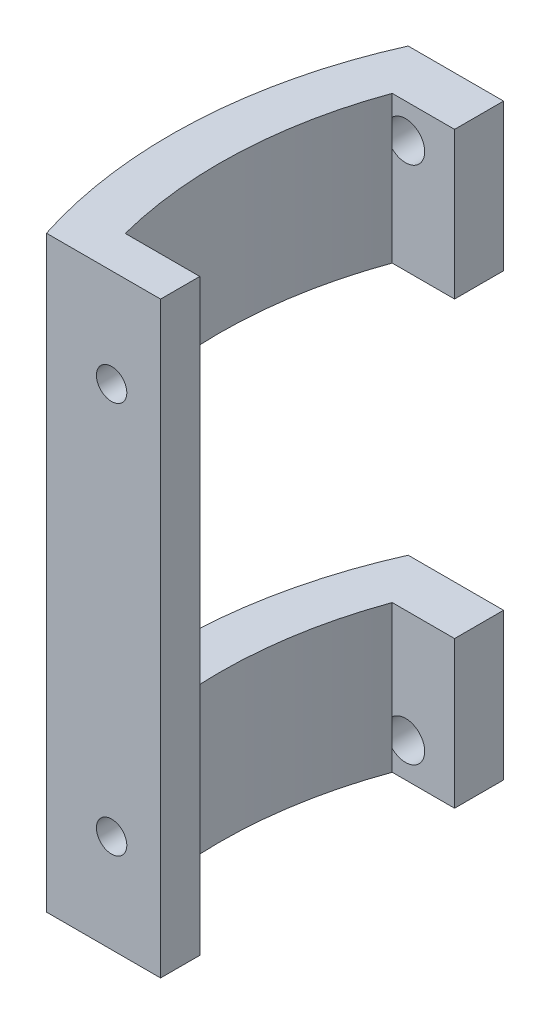
ISO-10303-21;
HEADER;
FILE_DESCRIPTION(('STEP AP214'),'2;1');
FILE_NAME('part.step','',(''),(''),'','','');
FILE_SCHEMA(('AUTOMOTIVE_DESIGN { 1 0 10303 214 1 1 1 1 }'));
ENDSEC;
DATA;
#1=APPLICATION_CONTEXT('core data for automotive mechanical design processes');
#2=APPLICATION_PROTOCOL_DEFINITION('international standard','automotive_design',2000,#1);
#3=PRODUCT_CONTEXT('',#1,'mechanical');
#4=PRODUCT('Part','Part','',(#3));
#5=PRODUCT_RELATED_PRODUCT_CATEGORY('part','',(#4));
#6=PRODUCT_DEFINITION_FORMATION('','',#4);
#7=PRODUCT_DEFINITION_CONTEXT('part definition',#1,'design');
#8=PRODUCT_DEFINITION('design','',#6,#7);
#9=PRODUCT_DEFINITION_SHAPE('','',#8);
#10=(LENGTH_UNIT() NAMED_UNIT(*) SI_UNIT(.MILLI.,.METRE.));
#11=(NAMED_UNIT(*) PLANE_ANGLE_UNIT() SI_UNIT($,.RADIAN.));
#12=(NAMED_UNIT(*) SI_UNIT($,.STERADIAN.) SOLID_ANGLE_UNIT());
#13=UNCERTAINTY_MEASURE_WITH_UNIT(LENGTH_MEASURE(1.E-05),#10,'distance_accuracy_value','');
#14=(GEOMETRIC_REPRESENTATION_CONTEXT(3) GLOBAL_UNCERTAINTY_ASSIGNED_CONTEXT((#13)) GLOBAL_UNIT_ASSIGNED_CONTEXT((#10,
#11,#12)) REPRESENTATION_CONTEXT('',''));
#15=CARTESIAN_POINT('',(0.,0.,0.));
#16=DIRECTION('',(0.,0.,1.));
#17=DIRECTION('',(1.,0.,0.));
#18=AXIS2_PLACEMENT_3D('',#15,#16,#17);
#19=CARTESIAN_POINT('',(0.,60.,0.));
#20=DIRECTION('',(0.,-1.,0.));
#21=DIRECTION('',(0.,0.,-1.));
#22=AXIS2_PLACEMENT_3D('',#19,#20,#21);
#23=CYLINDRICAL_SURFACE('',#22,44.);
#24=CARTESIAN_POINT('',(0.,15.,0.));
#25=DIRECTION('',(0.,-1.,0.));
#26=DIRECTION('',(0.,0.,-1.));
#27=AXIS2_PLACEMENT_3D('',#24,#25,#26);
#28=CIRCLE('',#27,44.);
#29=CARTESIAN_POINT('',(-42.6028168082816,15.,11.));
#30=VERTEX_POINT('',#29);
#31=CARTESIAN_POINT('',(-41.3642357598929,15.,-15.));
#32=VERTEX_POINT('',#31);
#33=EDGE_CURVE('E248',#30,#32,#28,.T.);
#34=ORIENTED_EDGE('',*,*,#33,.F.);
#35=DIRECTION('',(0.,-1.,0.));
#36=VECTOR('',#35,1.);
#37=CARTESIAN_POINT('',(-42.6028168082816,60.,11.));
#38=LINE('',#37,#36);
#39=CARTESIAN_POINT('',(-42.6028168082816,0.,11.));
#40=VERTEX_POINT('',#39);
#41=EDGE_CURVE('E304',#30,#40,#38,.T.);
#42=ORIENTED_EDGE('',*,*,#41,.T.);
#43=CARTESIAN_POINT('',(0.,0.,0.));
#44=DIRECTION('',(0.,1.,0.));
#45=DIRECTION('',(0.,0.,1.));
#46=AXIS2_PLACEMENT_3D('',#43,#44,#45);
#47=CIRCLE('',#46,44.);
#48=CARTESIAN_POINT('',(-41.3642357598929,0.,-15.));
#49=VERTEX_POINT('',#48);
#50=EDGE_CURVE('E269',#49,#40,#47,.T.);
#51=ORIENTED_EDGE('',*,*,#50,.F.);
#52=DIRECTION('',(0.,-1.,0.));
#53=VECTOR('',#52,1.);
#54=CARTESIAN_POINT('',(-41.3642357598929,60.,-15.));
#55=LINE('',#54,#53);
#56=CARTESIAN_POINT('',(-41.3642357598929,2.10667276225952,-15.));
#57=VERTEX_POINT('',#56);
#58=EDGE_CURVE('E196',#57,#49,#55,.T.);
#59=ORIENTED_EDGE('',*,*,#58,.F.);
#60=CARTESIAN_POINT('',(-41.3642357598929,4.89332723774048,-15.));
#61=VERTEX_POINT('',#60);
#62=EDGE_CURVE('E198',#61,#57,#55,.T.);
#63=ORIENTED_EDGE('',*,*,#62,.F.);
#64=EDGE_CURVE('E54',#32,#61,#55,.T.);
#65=ORIENTED_EDGE('',*,*,#64,.F.);
#66=EDGE_LOOP('',(#34,#42,#51,#59,#63,#65));
#67=FACE_BOUND('',#66,.T.);
#68=ADVANCED_FACE('F44',(#67),#23,.F.);
#69=CARTESIAN_POINT('',(0.,60.,-15.));
#70=DIRECTION('',(0.,0.,-1.));
#71=DIRECTION('',(-1.,0.,0.));
#72=AXIS2_PLACEMENT_3D('',#69,#70,#71);
#73=PLANE('',#72);
#74=DIRECTION('',(0.,-1.,0.));
#75=VECTOR('',#74,1.);
#76=CARTESIAN_POINT('',(-35.,60.,-15.));
#77=LINE('',#76,#75);
#78=CARTESIAN_POINT('',(-35.,15.,-15.));
#79=VERTEX_POINT('',#78);
#80=CARTESIAN_POINT('',(-35.,0.,-15.));
#81=VERTEX_POINT('',#80);
#82=EDGE_CURVE('E187',#79,#81,#77,.T.);
#83=ORIENTED_EDGE('',*,*,#82,.F.);
#84=DIRECTION('',(-1.,0.,0.));
#85=VECTOR('',#84,1.);
#86=CARTESIAN_POINT('',(0.,15.,-15.));
#87=LINE('',#86,#85);
#88=EDGE_CURVE('E241',#79,#32,#87,.T.);
#89=ORIENTED_EDGE('',*,*,#88,.T.);
#90=ORIENTED_EDGE('',*,*,#64,.T.);
#91=CARTESIAN_POINT('',(-40.,3.5,-15.));
#92=DIRECTION('',(0.,0.,-1.));
#93=DIRECTION('',(-1.,0.,0.));
#94=AXIS2_PLACEMENT_3D('',#91,#92,#93);
#95=CIRCLE('',#94,1.95);
#96=EDGE_CURVE('E258',#57,#61,#95,.F.);
#97=ORIENTED_EDGE('',*,*,#96,.F.);
#98=ORIENTED_EDGE('',*,*,#58,.T.);
#99=DIRECTION('',(1.,0.,0.));
#100=VECTOR('',#99,1.);
#101=CARTESIAN_POINT('',(0.,0.,-15.));
#102=LINE('',#101,#100);
#103=EDGE_CURVE('E308',#49,#81,#102,.T.);
#104=ORIENTED_EDGE('',*,*,#103,.T.);
#105=EDGE_LOOP('',(#83,#89,#90,#97,#98,#104));
#106=FACE_BOUND('',#105,.T.);
#107=ADVANCED_FACE('F386',(#106),#73,.F.);
#108=CARTESIAN_POINT('',(-35.,60.,0.));
#109=DIRECTION('',(1.,0.,0.));
#110=DIRECTION('',(0.,0.,-1.));
#111=AXIS2_PLACEMENT_3D('',#108,#109,#110);
#112=PLANE('',#111);
#113=DIRECTION('',(0.,0.,-1.));
#114=VECTOR('',#113,1.);
#115=CARTESIAN_POINT('',(-35.,15.,11.));
#116=LINE('',#115,#114);
#117=CARTESIAN_POINT('',(-35.,15.,-20.));
#118=VERTEX_POINT('',#117);
#119=EDGE_CURVE('E169',#79,#118,#116,.T.);
#120=ORIENTED_EDGE('',*,*,#119,.F.);
#121=ORIENTED_EDGE('',*,*,#82,.T.);
#122=DIRECTION('',(0.,0.,1.));
#123=VECTOR('',#122,1.);
#124=CARTESIAN_POINT('',(-35.,0.,0.));
#125=LINE('',#124,#123);
#126=CARTESIAN_POINT('',(-35.,0.,-20.));
#127=VERTEX_POINT('',#126);
#128=EDGE_CURVE('E311',#127,#81,#125,.T.);
#129=ORIENTED_EDGE('',*,*,#128,.F.);
#130=DIRECTION('',(0.,-1.,0.));
#131=VECTOR('',#130,1.);
#132=CARTESIAN_POINT('',(-35.,60.,-20.));
#133=LINE('',#132,#131);
#134=EDGE_CURVE('E188',#118,#127,#133,.T.);
#135=ORIENTED_EDGE('',*,*,#134,.F.);
#136=EDGE_LOOP('',(#120,#121,#129,#135));
#137=FACE_BOUND('',#136,.T.);
#138=ADVANCED_FACE('F384',(#137),#112,.T.);
#139=CARTESIAN_POINT('',(0.,60.,-20.));
#140=DIRECTION('',(0.,0.,-1.));
#141=DIRECTION('',(-1.,0.,0.));
#142=AXIS2_PLACEMENT_3D('',#139,#140,#141);
#143=PLANE('',#142);
#144=DIRECTION('',(1.,0.,0.));
#145=VECTOR('',#144,1.);
#146=CARTESIAN_POINT('',(-49.,15.,-20.));
#147=LINE('',#146,#145);
#148=CARTESIAN_POINT('',(-44.7325384926901,15.,-20.));
#149=VERTEX_POINT('',#148);
#150=EDGE_CURVE('E368',#149,#118,#147,.T.);
#151=ORIENTED_EDGE('',*,*,#150,.T.);
#152=ORIENTED_EDGE('',*,*,#134,.T.);
#153=DIRECTION('',(1.,0.,0.));
#154=VECTOR('',#153,1.);
#155=CARTESIAN_POINT('',(0.,0.,-20.));
#156=LINE('',#155,#154);
#157=CARTESIAN_POINT('',(-44.7325384926901,0.,-20.));
#158=VERTEX_POINT('',#157);
#159=EDGE_CURVE('E315',#158,#127,#156,.T.);
#160=ORIENTED_EDGE('',*,*,#159,.F.);
#161=DIRECTION('',(0.,-1.,0.));
#162=VECTOR('',#161,1.);
#163=CARTESIAN_POINT('',(-44.7325384926901,60.,-20.));
#164=LINE('',#163,#162);
#165=EDGE_CURVE('E340',#149,#158,#164,.T.);
#166=ORIENTED_EDGE('',*,*,#165,.F.);
#167=EDGE_LOOP('',(#151,#152,#160,#166));
#168=FACE_BOUND('',#167,.T.);
#169=CARTESIAN_POINT('',(-40.,3.5,-20.));
#170=DIRECTION('',(0.,0.,-1.));
#171=DIRECTION('',(-1.,0.,0.));
#172=AXIS2_PLACEMENT_3D('',#169,#170,#171);
#173=CIRCLE('',#172,1.95);
#174=CARTESIAN_POINT('',(-41.95,3.5,-20.));
#175=VERTEX_POINT('',#174);
#176=EDGE_CURVE('E254',#175,#175,#173,.T.);
#177=ORIENTED_EDGE('',*,*,#176,.F.);
#178=EDGE_LOOP('',(#177));
#179=FACE_BOUND('',#178,.T.);
#180=ADVANCED_FACE('F391',(#168,#179),#143,.T.);
#181=CARTESIAN_POINT('',(0.,45.,0.));
#182=DIRECTION('',(0.,1.,0.));
#183=DIRECTION('',(0.,0.,1.));
#184=AXIS2_PLACEMENT_3D('',#181,#182,#183);
#185=CIRCLE('',#184,44.);
#186=CARTESIAN_POINT('',(-41.3642357598929,45.,-15.));
#187=VERTEX_POINT('',#186);
#188=CARTESIAN_POINT('',(-42.6028168082816,45.,11.));
#189=VERTEX_POINT('',#188);
#190=EDGE_CURVE('E231',#187,#189,#185,.T.);
#191=ORIENTED_EDGE('',*,*,#190,.F.);
#192=CARTESIAN_POINT('',(-41.3642357598929,55.1066727622595,-15.));
#193=VERTEX_POINT('',#192);
#194=EDGE_CURVE('E205',#193,#187,#55,.T.);
#195=ORIENTED_EDGE('',*,*,#194,.F.);
#196=CARTESIAN_POINT('',(-41.3642357598929,57.8933272377405,-15.));
#197=VERTEX_POINT('',#196);
#198=EDGE_CURVE('E53',#197,#193,#55,.T.);
#199=ORIENTED_EDGE('',*,*,#198,.F.);
#200=CARTESIAN_POINT('',(-41.3642357598929,60.,-15.));
#201=VERTEX_POINT('',#200);
#202=EDGE_CURVE('E11',#201,#197,#55,.T.);
#203=ORIENTED_EDGE('',*,*,#202,.F.);
#204=CARTESIAN_POINT('',(0.,60.,0.));
#205=DIRECTION('',(0.,1.,0.));
#206=DIRECTION('',(0.,0.,1.));
#207=AXIS2_PLACEMENT_3D('',#204,#205,#206);
#208=CIRCLE('',#207,44.);
#209=CARTESIAN_POINT('',(-42.6028168082816,60.,11.));
#210=VERTEX_POINT('',#209);
#211=EDGE_CURVE('E281',#201,#210,#208,.T.);
#212=ORIENTED_EDGE('',*,*,#211,.T.);
#213=EDGE_CURVE('E233',#210,#189,#38,.T.);
#214=ORIENTED_EDGE('',*,*,#213,.T.);
#215=EDGE_LOOP('',(#191,#195,#199,#203,#212,#214));
#216=FACE_BOUND('',#215,.T.);
#217=ADVANCED_FACE('F46',(#216),#23,.F.);
#218=ORIENTED_EDGE('',*,*,#194,.T.);
#219=DIRECTION('',(1.,0.,0.));
#220=VECTOR('',#219,1.);
#221=CARTESIAN_POINT('',(0.,45.,-15.));
#222=LINE('',#221,#220);
#223=CARTESIAN_POINT('',(-35.,45.,-15.));
#224=VERTEX_POINT('',#223);
#225=EDGE_CURVE('E237',#187,#224,#222,.T.);
#226=ORIENTED_EDGE('',*,*,#225,.T.);
#227=CARTESIAN_POINT('',(-35.,60.,-15.));
#228=VERTEX_POINT('',#227);
#229=EDGE_CURVE('E178',#228,#224,#77,.T.);
#230=ORIENTED_EDGE('',*,*,#229,.F.);
#231=DIRECTION('',(1.,0.,0.));
#232=VECTOR('',#231,1.);
#233=CARTESIAN_POINT('',(0.,60.,-15.));
#234=LINE('',#233,#232);
#235=EDGE_CURVE('E284',#201,#228,#234,.T.);
#236=ORIENTED_EDGE('',*,*,#235,.F.);
#237=ORIENTED_EDGE('',*,*,#202,.T.);
#238=CARTESIAN_POINT('',(-40.,56.5,-15.));
#239=DIRECTION('',(0.,0.,-1.));
#240=DIRECTION('',(-1.,0.,0.));
#241=AXIS2_PLACEMENT_3D('',#238,#239,#240);
#242=CIRCLE('',#241,1.95);
#243=EDGE_CURVE('E222',#193,#197,#242,.F.);
#244=ORIENTED_EDGE('',*,*,#243,.F.);
#245=EDGE_LOOP('',(#218,#226,#230,#236,#237,#244));
#246=FACE_BOUND('',#245,.T.);
#247=ADVANCED_FACE('F223',(#246),#73,.F.);
#248=DIRECTION('',(0.,0.,1.));
#249=VECTOR('',#248,1.);
#250=CARTESIAN_POINT('',(-35.,45.,-20.));
#251=LINE('',#250,#249);
#252=CARTESIAN_POINT('',(-35.,45.,-20.));
#253=VERTEX_POINT('',#252);
#254=EDGE_CURVE('E163',#253,#224,#251,.T.);
#255=ORIENTED_EDGE('',*,*,#254,.F.);
#256=CARTESIAN_POINT('',(-35.,60.,-20.));
#257=VERTEX_POINT('',#256);
#258=EDGE_CURVE('E175',#257,#253,#133,.T.);
#259=ORIENTED_EDGE('',*,*,#258,.F.);
#260=DIRECTION('',(0.,0.,1.));
#261=VECTOR('',#260,1.);
#262=CARTESIAN_POINT('',(-35.,60.,0.));
#263=LINE('',#262,#261);
#264=EDGE_CURVE('E288',#257,#228,#263,.T.);
#265=ORIENTED_EDGE('',*,*,#264,.T.);
#266=ORIENTED_EDGE('',*,*,#229,.T.);
#267=EDGE_LOOP('',(#255,#259,#265,#266));
#268=FACE_BOUND('',#267,.T.);
#269=ADVANCED_FACE('F173',(#268),#112,.T.);
#270=DIRECTION('',(1.,0.,0.));
#271=VECTOR('',#270,1.);
#272=CARTESIAN_POINT('',(-49.,45.,-20.));
#273=LINE('',#272,#271);
#274=CARTESIAN_POINT('',(-44.7325384926901,45.,-20.));
#275=VERTEX_POINT('',#274);
#276=EDGE_CURVE('E160',#275,#253,#273,.T.);
#277=ORIENTED_EDGE('',*,*,#276,.F.);
#278=CARTESIAN_POINT('',(-44.7325384926901,60.,-20.));
#279=VERTEX_POINT('',#278);
#280=EDGE_CURVE('E192',#279,#275,#164,.T.);
#281=ORIENTED_EDGE('',*,*,#280,.F.);
#282=DIRECTION('',(1.,0.,0.));
#283=VECTOR('',#282,1.);
#284=CARTESIAN_POINT('',(0.,60.,-20.));
#285=LINE('',#284,#283);
#286=EDGE_CURVE('E185',#279,#257,#285,.T.);
#287=ORIENTED_EDGE('',*,*,#286,.T.);
#288=ORIENTED_EDGE('',*,*,#258,.T.);
#289=EDGE_LOOP('',(#277,#281,#287,#288));
#290=FACE_BOUND('',#289,.T.);
#291=CARTESIAN_POINT('',(-40.,56.5,-20.));
#292=DIRECTION('',(0.,0.,-1.));
#293=DIRECTION('',(-1.,0.,0.));
#294=AXIS2_PLACEMENT_3D('',#291,#292,#293);
#295=CIRCLE('',#294,1.95);
#296=CARTESIAN_POINT('',(-41.95,56.5,-20.));
#297=VERTEX_POINT('',#296);
#298=EDGE_CURVE('E227',#297,#297,#295,.T.);
#299=ORIENTED_EDGE('',*,*,#298,.F.);
#300=EDGE_LOOP('',(#299));
#301=FACE_BOUND('',#300,.T.);
#302=ADVANCED_FACE('F182',(#290,#301),#143,.T.);
#303=CARTESIAN_POINT('',(0.,60.,0.));
#304=DIRECTION('',(0.,-1.,0.));
#305=DIRECTION('',(0.,0.,-1.));
#306=AXIS2_PLACEMENT_3D('',#303,#304,#305);
#307=CYLINDRICAL_SURFACE('',#306,49.);
#308=ORIENTED_EDGE('',*,*,#280,.T.);
#309=CARTESIAN_POINT('',(0.,45.,0.));
#310=DIRECTION('',(0.,1.,0.));
#311=DIRECTION('',(0.,0.,1.));
#312=AXIS2_PLACEMENT_3D('',#309,#310,#311);
#313=CIRCLE('',#312,49.);
#314=CARTESIAN_POINT('',(-47.7493455452533,45.,11.));
#315=VERTEX_POINT('',#314);
#316=EDGE_CURVE('E61',#275,#315,#313,.T.);
#317=ORIENTED_EDGE('',*,*,#316,.T.);
#318=DIRECTION('',(0.,-1.,0.));
#319=VECTOR('',#318,1.);
#320=CARTESIAN_POINT('',(-47.7493455452533,60.,11.));
#321=LINE('',#320,#319);
#322=CARTESIAN_POINT('',(-47.7493455452533,15.,11.));
#323=VERTEX_POINT('',#322);
#324=EDGE_CURVE('E251',#315,#323,#321,.T.);
#325=ORIENTED_EDGE('',*,*,#324,.T.);
#326=CARTESIAN_POINT('',(0.,15.,0.));
#327=DIRECTION('',(0.,-1.,0.));
#328=DIRECTION('',(0.,0.,-1.));
#329=AXIS2_PLACEMENT_3D('',#326,#327,#328);
#330=CIRCLE('',#329,49.);
#331=EDGE_CURVE('E236',#323,#149,#330,.T.);
#332=ORIENTED_EDGE('',*,*,#331,.T.);
#333=ORIENTED_EDGE('',*,*,#165,.T.);
#334=CARTESIAN_POINT('',(0.,0.,0.));
#335=DIRECTION('',(0.,1.,0.));
#336=DIRECTION('',(0.,0.,1.));
#337=AXIS2_PLACEMENT_3D('',#334,#335,#336);
#338=CIRCLE('',#337,49.);
#339=CARTESIAN_POINT('',(-46.6476151587624,0.,15.));
#340=VERTEX_POINT('',#339);
#341=EDGE_CURVE('E320',#158,#340,#338,.T.);
#342=ORIENTED_EDGE('',*,*,#341,.T.);
#343=DIRECTION('',(0.,-1.,0.));
#344=VECTOR('',#343,1.);
#345=CARTESIAN_POINT('',(-46.6476151587624,60.,15.));
#346=LINE('',#345,#344);
#347=CARTESIAN_POINT('',(-46.6476151587624,60.,15.));
#348=VERTEX_POINT('',#347);
#349=EDGE_CURVE('E337',#348,#340,#346,.T.);
#350=ORIENTED_EDGE('',*,*,#349,.F.);
#351=CARTESIAN_POINT('',(0.,60.,0.));
#352=DIRECTION('',(0.,1.,0.));
#353=DIRECTION('',(0.,0.,1.));
#354=AXIS2_PLACEMENT_3D('',#351,#352,#353);
#355=CIRCLE('',#354,49.);
#356=EDGE_CURVE('E294',#279,#348,#355,.T.);
#357=ORIENTED_EDGE('',*,*,#356,.F.);
#358=EDGE_LOOP('',(#308,#317,#325,#332,#333,#342,#350,#357));
#359=FACE_BOUND('',#358,.T.);
#360=ADVANCED_FACE('F350',(#359),#307,.T.);
#361=CARTESIAN_POINT('',(0.,60.,15.));
#362=DIRECTION('',(0.,0.,-1.));
#363=DIRECTION('',(-1.,0.,0.));
#364=AXIS2_PLACEMENT_3D('',#361,#362,#363);
#365=PLANE('',#364);
#366=CARTESIAN_POINT('',(-39.9976151587624,50.,15.));
#367=DIRECTION('',(0.,0.,-1.));
#368=DIRECTION('',(-1.,0.,0.));
#369=AXIS2_PLACEMENT_3D('',#366,#367,#368);
#370=CIRCLE('',#369,1.55);
#371=CARTESIAN_POINT('',(-41.5476151587624,50.,15.));
#372=VERTEX_POINT('',#371);
#373=EDGE_CURVE('E265',#372,#372,#370,.T.);
#374=ORIENTED_EDGE('',*,*,#373,.T.);
#375=EDGE_LOOP('',(#374));
#376=FACE_BOUND('',#375,.T.);
#377=CARTESIAN_POINT('',(-39.9976151587624,9.99999999999999,15.));
#378=DIRECTION('',(0.,0.,-1.));
#379=DIRECTION('',(-1.,0.,0.));
#380=AXIS2_PLACEMENT_3D('',#377,#378,#379);
#381=CIRCLE('',#380,1.55);
#382=CARTESIAN_POINT('',(-41.5476151587624,9.99999999999999,15.));
#383=VERTEX_POINT('',#382);
#384=EDGE_CURVE('E260',#383,#383,#381,.T.);
#385=ORIENTED_EDGE('',*,*,#384,.T.);
#386=EDGE_LOOP('',(#385));
#387=FACE_BOUND('',#386,.T.);
#388=DIRECTION('',(1.,0.,0.));
#389=VECTOR('',#388,1.);
#390=CARTESIAN_POINT('',(0.,0.,15.));
#391=LINE('',#390,#389);
#392=CARTESIAN_POINT('',(-35.,0.,15.));
#393=VERTEX_POINT('',#392);
#394=EDGE_CURVE('E323',#340,#393,#391,.T.);
#395=ORIENTED_EDGE('',*,*,#394,.T.);
#396=DIRECTION('',(0.,-1.,0.));
#397=VECTOR('',#396,1.);
#398=CARTESIAN_POINT('',(-35.,60.,15.));
#399=LINE('',#398,#397);
#400=CARTESIAN_POINT('',(-35.,60.,15.));
#401=VERTEX_POINT('',#400);
#402=EDGE_CURVE('E335',#401,#393,#399,.T.);
#403=ORIENTED_EDGE('',*,*,#402,.F.);
#404=DIRECTION('',(1.,0.,0.));
#405=VECTOR('',#404,1.);
#406=CARTESIAN_POINT('',(0.,60.,15.));
#407=LINE('',#406,#405);
#408=EDGE_CURVE('E297',#348,#401,#407,.T.);
#409=ORIENTED_EDGE('',*,*,#408,.F.);
#410=ORIENTED_EDGE('',*,*,#349,.T.);
#411=EDGE_LOOP('',(#395,#403,#409,#410));
#412=FACE_BOUND('',#411,.T.);
#413=ADVANCED_FACE('F429',(#376,#387,#412),#365,.F.);
#414=CARTESIAN_POINT('',(-35.,0.,11.));
#415=VERTEX_POINT('',#414);
#416=EDGE_CURVE('E316',#415,#393,#125,.T.);
#417=ORIENTED_EDGE('',*,*,#416,.F.);
#418=DIRECTION('',(0.,-1.,0.));
#419=VECTOR('',#418,1.);
#420=CARTESIAN_POINT('',(-35.,60.,11.));
#421=LINE('',#420,#419);
#422=CARTESIAN_POINT('',(-35.,60.,11.));
#423=VERTEX_POINT('',#422);
#424=EDGE_CURVE('E332',#423,#415,#421,.T.);
#425=ORIENTED_EDGE('',*,*,#424,.F.);
#426=EDGE_CURVE('E291',#423,#401,#263,.T.);
#427=ORIENTED_EDGE('',*,*,#426,.T.);
#428=ORIENTED_EDGE('',*,*,#402,.T.);
#429=EDGE_LOOP('',(#417,#425,#427,#428));
#430=FACE_BOUND('',#429,.T.);
#431=ADVANCED_FACE('F424',(#430),#112,.T.);
#432=CARTESIAN_POINT('',(0.,60.,11.));
#433=DIRECTION('',(0.,0.,-1.));
#434=DIRECTION('',(-1.,0.,0.));
#435=AXIS2_PLACEMENT_3D('',#432,#433,#434);
#436=PLANE('',#435);
#437=ORIENTED_EDGE('',*,*,#424,.T.);
#438=DIRECTION('',(1.,0.,0.));
#439=VECTOR('',#438,1.);
#440=CARTESIAN_POINT('',(0.,0.,11.));
#441=LINE('',#440,#439);
#442=EDGE_CURVE('E285',#40,#415,#441,.T.);
#443=ORIENTED_EDGE('',*,*,#442,.F.);
#444=ORIENTED_EDGE('',*,*,#41,.F.);
#445=DIRECTION('',(1.,0.,0.));
#446=VECTOR('',#445,1.);
#447=CARTESIAN_POINT('',(-49.,15.,11.));
#448=LINE('',#447,#446);
#449=EDGE_CURVE('E365',#323,#30,#448,.T.);
#450=ORIENTED_EDGE('',*,*,#449,.F.);
#451=ORIENTED_EDGE('',*,*,#324,.F.);
#452=DIRECTION('',(1.,0.,0.));
#453=VECTOR('',#452,1.);
#454=CARTESIAN_POINT('',(-49.,45.,11.));
#455=LINE('',#454,#453);
#456=EDGE_CURVE('E168',#315,#189,#455,.T.);
#457=ORIENTED_EDGE('',*,*,#456,.T.);
#458=ORIENTED_EDGE('',*,*,#213,.F.);
#459=DIRECTION('',(1.,0.,0.));
#460=VECTOR('',#459,1.);
#461=CARTESIAN_POINT('',(0.,60.,11.));
#462=LINE('',#461,#460);
#463=EDGE_CURVE('E300',#210,#423,#462,.T.);
#464=ORIENTED_EDGE('',*,*,#463,.T.);
#465=EDGE_LOOP('',(#437,#443,#444,#450,#451,#457,#458,#464));
#466=FACE_BOUND('',#465,.T.);
#467=CARTESIAN_POINT('',(-39.9976151587624,50.,11.));
#468=DIRECTION('',(0.,0.,-1.));
#469=DIRECTION('',(-1.,0.,0.));
#470=AXIS2_PLACEMENT_3D('',#467,#468,#469);
#471=CIRCLE('',#470,1.55);
#472=CARTESIAN_POINT('',(-41.5476151587624,50.,11.));
#473=VERTEX_POINT('',#472);
#474=EDGE_CURVE('E270',#473,#473,#471,.T.);
#475=ORIENTED_EDGE('',*,*,#474,.F.);
#476=EDGE_LOOP('',(#475));
#477=FACE_BOUND('',#476,.T.);
#478=CARTESIAN_POINT('',(-39.9976151587624,9.99999999999999,11.));
#479=DIRECTION('',(0.,0.,-1.));
#480=DIRECTION('',(-1.,0.,0.));
#481=AXIS2_PLACEMENT_3D('',#478,#479,#480);
#482=CIRCLE('',#481,1.55);
#483=CARTESIAN_POINT('',(-41.5476151587624,9.99999999999999,11.));
#484=VERTEX_POINT('',#483);
#485=EDGE_CURVE('E274',#484,#484,#482,.T.);
#486=ORIENTED_EDGE('',*,*,#485,.F.);
#487=EDGE_LOOP('',(#486));
#488=FACE_BOUND('',#487,.T.);
#489=ADVANCED_FACE('F358',(#466,#477,#488),#436,.T.);
#490=CARTESIAN_POINT('',(0.,60.,0.));
#491=DIRECTION('',(0.,1.,0.));
#492=DIRECTION('',(0.,0.,1.));
#493=AXIS2_PLACEMENT_3D('',#490,#491,#492);
#494=PLANE('',#493);
#495=ORIENTED_EDGE('',*,*,#211,.F.);
#496=ORIENTED_EDGE('',*,*,#235,.T.);
#497=ORIENTED_EDGE('',*,*,#264,.F.);
#498=ORIENTED_EDGE('',*,*,#286,.F.);
#499=ORIENTED_EDGE('',*,*,#356,.T.);
#500=ORIENTED_EDGE('',*,*,#408,.T.);
#501=ORIENTED_EDGE('',*,*,#426,.F.);
#502=ORIENTED_EDGE('',*,*,#463,.F.);
#503=EDGE_LOOP('',(#495,#496,#497,#498,#499,#500,#501,#502));
#504=FACE_BOUND('',#503,.T.);
#505=ADVANCED_FACE('F353',(#504),#494,.T.);
#506=CARTESIAN_POINT('',(0.,0.,0.));
#507=DIRECTION('',(0.,1.,0.));
#508=DIRECTION('',(0.,0.,1.));
#509=AXIS2_PLACEMENT_3D('',#506,#507,#508);
#510=PLANE('',#509);
#511=ORIENTED_EDGE('',*,*,#50,.T.);
#512=ORIENTED_EDGE('',*,*,#442,.T.);
#513=ORIENTED_EDGE('',*,*,#416,.T.);
#514=ORIENTED_EDGE('',*,*,#394,.F.);
#515=ORIENTED_EDGE('',*,*,#341,.F.);
#516=ORIENTED_EDGE('',*,*,#159,.T.);
#517=ORIENTED_EDGE('',*,*,#128,.T.);
#518=ORIENTED_EDGE('',*,*,#103,.F.);
#519=EDGE_LOOP('',(#511,#512,#513,#514,#515,#516,#517,#518));
#520=FACE_BOUND('',#519,.T.);
#521=ADVANCED_FACE('F389',(#520),#510,.F.);
#522=CARTESIAN_POINT('',(-39.9976151587624,9.99999999999999,15.));
#523=DIRECTION('',(0.,0.,-1.));
#524=DIRECTION('',(-1.,0.,0.));
#525=AXIS2_PLACEMENT_3D('',#522,#523,#524);
#526=CYLINDRICAL_SURFACE('',#525,1.55);
#527=ORIENTED_EDGE('',*,*,#384,.F.);
#528=EDGE_LOOP('',(#527));
#529=FACE_BOUND('',#528,.T.);
#530=ORIENTED_EDGE('',*,*,#485,.T.);
#531=EDGE_LOOP('',(#530));
#532=FACE_BOUND('',#531,.T.);
#533=ADVANCED_FACE('F439',(#529,#532),#526,.F.);
#534=CARTESIAN_POINT('',(-39.9976151587624,50.,15.));
#535=DIRECTION('',(0.,0.,-1.));
#536=DIRECTION('',(-1.,0.,0.));
#537=AXIS2_PLACEMENT_3D('',#534,#535,#536);
#538=CYLINDRICAL_SURFACE('',#537,1.55);
#539=ORIENTED_EDGE('',*,*,#373,.F.);
#540=EDGE_LOOP('',(#539));
#541=FACE_BOUND('',#540,.T.);
#542=ORIENTED_EDGE('',*,*,#474,.T.);
#543=EDGE_LOOP('',(#542));
#544=FACE_BOUND('',#543,.T.);
#545=ADVANCED_FACE('F444',(#541,#544),#538,.F.);
#546=CARTESIAN_POINT('',(-40.,56.5,-9.48456710674493));
#547=DIRECTION('',(0.,0.,-1.));
#548=DIRECTION('',(-1.,0.,0.));
#549=AXIS2_PLACEMENT_3D('',#546,#547,#548);
#550=CYLINDRICAL_SURFACE('',#549,1.95);
#551=ORIENTED_EDGE('',*,*,#243,.T.);
#552=EDGE_CURVE('E219',#197,#193,#242,.F.);
#553=ORIENTED_EDGE('',*,*,#552,.T.);
#554=EDGE_LOOP('',(#551,#553));
#555=FACE_BOUND('',#554,.T.);
#556=ORIENTED_EDGE('',*,*,#298,.T.);
#557=EDGE_LOOP('',(#556));
#558=FACE_BOUND('',#557,.T.);
#559=ADVANCED_FACE('F407',(#555,#558),#550,.F.);
#560=CARTESIAN_POINT('',(0.,60.,-15.));
#561=DIRECTION('',(0.,0.,-1.));
#562=DIRECTION('',(-1.,0.,0.));
#563=AXIS2_PLACEMENT_3D('',#560,#561,#562);
#564=PLANE('',#563);
#565=ORIENTED_EDGE('',*,*,#552,.F.);
#566=ORIENTED_EDGE('',*,*,#198,.T.);
#567=EDGE_LOOP('',(#565,#566));
#568=FACE_BOUND('',#567,.T.);
#569=ADVANCED_FACE('F218',(#568),#564,.T.);
#570=CARTESIAN_POINT('',(-40.,3.5,-9.48456710674493));
#571=DIRECTION('',(0.,0.,-1.));
#572=DIRECTION('',(-1.,0.,0.));
#573=AXIS2_PLACEMENT_3D('',#570,#571,#572);
#574=CYLINDRICAL_SURFACE('',#573,1.95);
#575=ORIENTED_EDGE('',*,*,#96,.T.);
#576=EDGE_CURVE('E68',#61,#57,#95,.F.);
#577=ORIENTED_EDGE('',*,*,#576,.T.);
#578=EDGE_LOOP('',(#575,#577));
#579=FACE_BOUND('',#578,.T.);
#580=ORIENTED_EDGE('',*,*,#176,.T.);
#581=EDGE_LOOP('',(#580));
#582=FACE_BOUND('',#581,.T.);
#583=ADVANCED_FACE('F397',(#579,#582),#574,.F.);
#584=CARTESIAN_POINT('',(0.,60.,-15.));
#585=DIRECTION('',(0.,0.,-1.));
#586=DIRECTION('',(-1.,0.,0.));
#587=AXIS2_PLACEMENT_3D('',#584,#585,#586);
#588=PLANE('',#587);
#589=ORIENTED_EDGE('',*,*,#576,.F.);
#590=ORIENTED_EDGE('',*,*,#62,.T.);
#591=EDGE_LOOP('',(#589,#590));
#592=FACE_BOUND('',#591,.T.);
#593=ADVANCED_FACE('F399',(#592),#588,.T.);
#594=CARTESIAN_POINT('',(-49.,15.,11.));
#595=DIRECTION('',(0.,-1.,0.));
#596=DIRECTION('',(0.,0.,-1.));
#597=AXIS2_PLACEMENT_3D('',#594,#595,#596);
#598=PLANE('',#597);
#599=ORIENTED_EDGE('',*,*,#33,.T.);
#600=ORIENTED_EDGE('',*,*,#88,.F.);
#601=ORIENTED_EDGE('',*,*,#119,.T.);
#602=ORIENTED_EDGE('',*,*,#150,.F.);
#603=ORIENTED_EDGE('',*,*,#331,.F.);
#604=ORIENTED_EDGE('',*,*,#449,.T.);
#605=EDGE_LOOP('',(#599,#600,#601,#602,#603,#604));
#606=FACE_BOUND('',#605,.T.);
#607=ADVANCED_FACE('F381',(#606),#598,.F.);
#608=CARTESIAN_POINT('',(-49.,45.,-20.));
#609=DIRECTION('',(0.,1.,0.));
#610=DIRECTION('',(0.,0.,1.));
#611=AXIS2_PLACEMENT_3D('',#608,#609,#610);
#612=PLANE('',#611);
#613=ORIENTED_EDGE('',*,*,#190,.T.);
#614=ORIENTED_EDGE('',*,*,#456,.F.);
#615=ORIENTED_EDGE('',*,*,#316,.F.);
#616=ORIENTED_EDGE('',*,*,#276,.T.);
#617=ORIENTED_EDGE('',*,*,#254,.T.);
#618=ORIENTED_EDGE('',*,*,#225,.F.);
#619=EDGE_LOOP('',(#613,#614,#615,#616,#617,#618));
#620=FACE_BOUND('',#619,.T.);
#621=ADVANCED_FACE('F162',(#620),#612,.F.);
#622=CLOSED_SHELL('',(#68,#107,#138,#180,#217,#247,#269,#302,#360,#413,#431,#489,#505,#521,#533,
#545,#559,#569,#583,#593,#607,#621));
#623=MANIFOLD_SOLID_BREP('B2',#622);
#624=ADVANCED_BREP_SHAPE_REPRESENTATION('',(#18,#623),#14);
#625=SHAPE_DEFINITION_REPRESENTATION(#9,#624);
ENDSEC;
END-ISO-10303-21;
